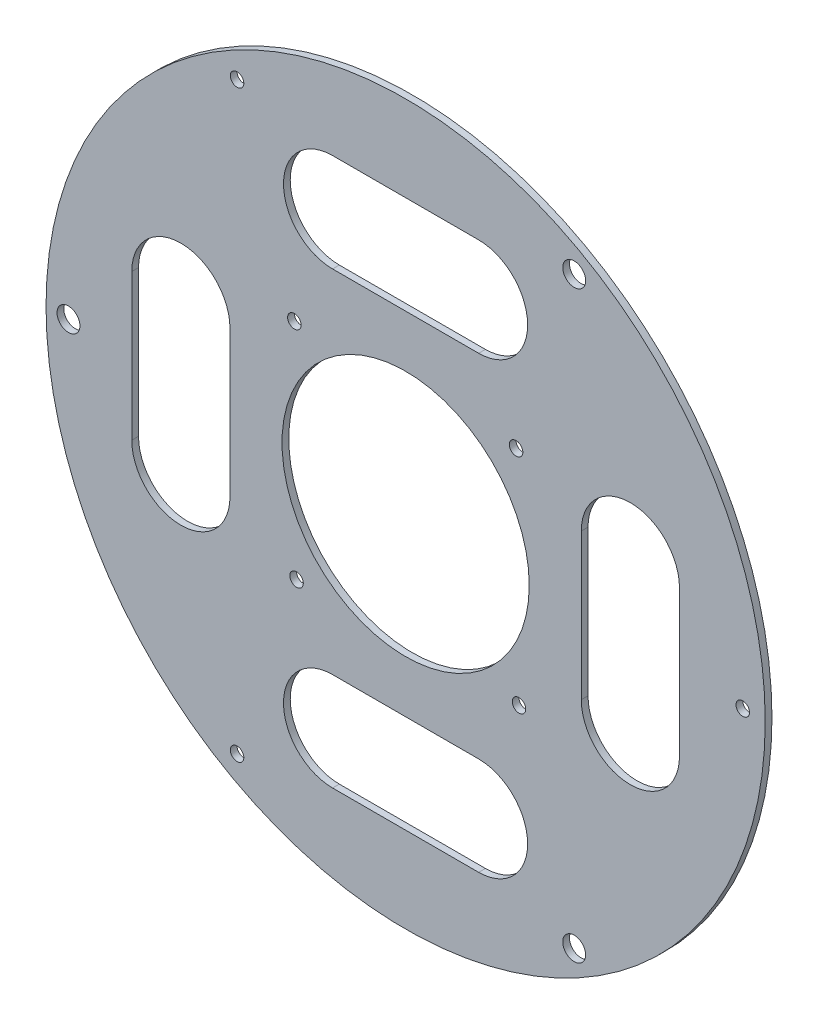
ISO-10303-21;
HEADER;
FILE_DESCRIPTION(('STEP AP214'),'2;1');
FILE_NAME('part.step','',(''),(''),'','','');
FILE_SCHEMA(('AUTOMOTIVE_DESIGN { 1 0 10303 214 1 1 1 1 }'));
ENDSEC;
DATA;
#1=APPLICATION_CONTEXT('core data for automotive mechanical design processes');
#2=APPLICATION_PROTOCOL_DEFINITION('international standard','automotive_design',2000,#1);
#3=PRODUCT_CONTEXT('',#1,'mechanical');
#4=PRODUCT('Part','Part','',(#3));
#5=PRODUCT_RELATED_PRODUCT_CATEGORY('part','',(#4));
#6=PRODUCT_DEFINITION_FORMATION('','',#4);
#7=PRODUCT_DEFINITION_CONTEXT('part definition',#1,'design');
#8=PRODUCT_DEFINITION('design','',#6,#7);
#9=PRODUCT_DEFINITION_SHAPE('','',#8);
#10=(LENGTH_UNIT() NAMED_UNIT(*) SI_UNIT(.MILLI.,.METRE.));
#11=(NAMED_UNIT(*) PLANE_ANGLE_UNIT() SI_UNIT($,.RADIAN.));
#12=(NAMED_UNIT(*) SI_UNIT($,.STERADIAN.) SOLID_ANGLE_UNIT());
#13=UNCERTAINTY_MEASURE_WITH_UNIT(LENGTH_MEASURE(1.E-05),#10,'distance_accuracy_value','');
#14=(GEOMETRIC_REPRESENTATION_CONTEXT(3) GLOBAL_UNCERTAINTY_ASSIGNED_CONTEXT((#13)) GLOBAL_UNIT_ASSIGNED_CONTEXT((#10,
#11,#12)) REPRESENTATION_CONTEXT('',''));
#15=CARTESIAN_POINT('',(0.,0.,0.));
#16=DIRECTION('',(0.,0.,1.));
#17=DIRECTION('',(1.,0.,0.));
#18=AXIS2_PLACEMENT_3D('',#15,#16,#17);
#19=CARTESIAN_POINT('',(0.,-78.1572470545592,3.));
#20=DIRECTION('',(0.,1.,0.));
#21=DIRECTION('',(-1.,0.,0.));
#22=AXIS2_PLACEMENT_3D('',#19,#20,#21);
#23=PLANE('',#22);
#24=DIRECTION('',(1.,0.,0.));
#25=VECTOR('',#24,1.);
#26=CARTESIAN_POINT('',(0.,-78.1572470545592,0.));
#27=LINE('',#26,#25);
#28=CARTESIAN_POINT('',(-32.5,-78.1572470545592,0.));
#29=VERTEX_POINT('',#28);
#30=CARTESIAN_POINT('',(32.5,-78.1572470545592,0.));
#31=VERTEX_POINT('',#30);
#32=EDGE_CURVE('E259',#29,#31,#27,.T.);
#33=ORIENTED_EDGE('',*,*,#32,.T.);
#34=DIRECTION('',(0.,0.,-1.));
#35=VECTOR('',#34,1.);
#36=CARTESIAN_POINT('',(32.5,-78.1572470545592,3.));
#37=LINE('',#36,#35);
#38=CARTESIAN_POINT('',(32.5,-78.1572470545592,3.));
#39=VERTEX_POINT('',#38);
#40=EDGE_CURVE('E11',#39,#31,#37,.T.);
#41=ORIENTED_EDGE('',*,*,#40,.F.);
#42=DIRECTION('',(1.,0.,0.));
#43=VECTOR('',#42,1.);
#44=CARTESIAN_POINT('',(0.,-78.1572470545592,3.));
#45=LINE('',#44,#43);
#46=CARTESIAN_POINT('',(-32.5,-78.1572470545592,3.));
#47=VERTEX_POINT('',#46);
#48=EDGE_CURVE('E170',#47,#39,#45,.T.);
#49=ORIENTED_EDGE('',*,*,#48,.F.);
#50=DIRECTION('',(0.,0.,-1.));
#51=VECTOR('',#50,1.);
#52=CARTESIAN_POINT('',(-32.5,-78.1572470545592,3.));
#53=LINE('',#52,#51);
#54=EDGE_CURVE('E62',#47,#29,#53,.T.);
#55=ORIENTED_EDGE('',*,*,#54,.T.);
#56=EDGE_LOOP('',(#33,#41,#49,#55));
#57=FACE_BOUND('',#56,.T.);
#58=ADVANCED_FACE('F43',(#57),#23,.F.);
#59=CARTESIAN_POINT('',(32.4365969784117,-100.,3.));
#60=DIRECTION('',(0.,0.,-1.));
#61=DIRECTION('',(-1.,0.,0.));
#62=AXIS2_PLACEMENT_3D('',#59,#60,#61);
#63=CYLINDRICAL_SURFACE('',#62,21.8428449653133);
#64=CARTESIAN_POINT('',(32.4365969784117,-100.,0.));
#65=DIRECTION('',(0.,0.,1.));
#66=DIRECTION('',(1.,0.,0.));
#67=AXIS2_PLACEMENT_3D('',#64,#65,#66);
#68=CIRCLE('',#67,21.8428449653133);
#69=CARTESIAN_POINT('',(32.5000000000185,-121.842752945441,0.));
#70=VERTEX_POINT('',#69);
#71=EDGE_CURVE('E176',#31,#70,#68,.F.);
#72=ORIENTED_EDGE('',*,*,#71,.T.);
#73=DIRECTION('',(0.,0.,-1.));
#74=VECTOR('',#73,1.);
#75=CARTESIAN_POINT('',(32.5000000000185,-121.842752945441,3.));
#76=LINE('',#75,#74);
#77=CARTESIAN_POINT('',(32.5000000000185,-121.842752945441,3.));
#78=VERTEX_POINT('',#77);
#79=EDGE_CURVE('E53',#78,#70,#76,.T.);
#80=ORIENTED_EDGE('',*,*,#79,.F.);
#81=CARTESIAN_POINT('',(32.4365969784117,-100.,3.));
#82=DIRECTION('',(0.,0.,1.));
#83=DIRECTION('',(1.,0.,0.));
#84=AXIS2_PLACEMENT_3D('',#81,#82,#83);
#85=CIRCLE('',#84,21.8428449653133);
#86=EDGE_CURVE('E164',#39,#78,#85,.F.);
#87=ORIENTED_EDGE('',*,*,#86,.F.);
#88=ORIENTED_EDGE('',*,*,#40,.T.);
#89=EDGE_LOOP('',(#72,#80,#87,#88));
#90=FACE_BOUND('',#89,.T.);
#91=ADVANCED_FACE('F175',(#90),#63,.F.);
#92=CARTESIAN_POINT('',(0.,-121.842752945441,3.));
#93=DIRECTION('',(0.,1.,0.));
#94=DIRECTION('',(-1.,0.,0.));
#95=AXIS2_PLACEMENT_3D('',#92,#93,#94);
#96=PLANE('',#95);
#97=DIRECTION('',(1.,0.,0.));
#98=VECTOR('',#97,1.);
#99=CARTESIAN_POINT('',(0.,-121.842752945441,0.));
#100=LINE('',#99,#98);
#101=CARTESIAN_POINT('',(-32.5,-121.842752945441,0.));
#102=VERTEX_POINT('',#101);
#103=EDGE_CURVE('E262',#102,#70,#100,.T.);
#104=ORIENTED_EDGE('',*,*,#103,.F.);
#105=DIRECTION('',(0.,0.,-1.));
#106=VECTOR('',#105,1.);
#107=CARTESIAN_POINT('',(-32.5,-121.842752945441,3.));
#108=LINE('',#107,#106);
#109=CARTESIAN_POINT('',(-32.5,-121.842752945441,3.));
#110=VERTEX_POINT('',#109);
#111=EDGE_CURVE('E112',#110,#102,#108,.T.);
#112=ORIENTED_EDGE('',*,*,#111,.F.);
#113=DIRECTION('',(1.,0.,0.));
#114=VECTOR('',#113,1.);
#115=CARTESIAN_POINT('',(0.,-121.842752945441,3.));
#116=LINE('',#115,#114);
#117=EDGE_CURVE('E169',#110,#78,#116,.T.);
#118=ORIENTED_EDGE('',*,*,#117,.T.);
#119=ORIENTED_EDGE('',*,*,#79,.T.);
#120=EDGE_LOOP('',(#104,#112,#118,#119));
#121=FACE_BOUND('',#120,.T.);
#122=ADVANCED_FACE('F180',(#121),#96,.T.);
#123=CARTESIAN_POINT('',(0.,78.1572470545592,3.));
#124=DIRECTION('',(0.,1.,0.));
#125=DIRECTION('',(-1.,0.,0.));
#126=AXIS2_PLACEMENT_3D('',#123,#124,#125);
#127=PLANE('',#126);
#128=DIRECTION('',(1.,0.,0.));
#129=VECTOR('',#128,1.);
#130=CARTESIAN_POINT('',(0.,78.1572470545592,0.));
#131=LINE('',#130,#129);
#132=CARTESIAN_POINT('',(-32.5,78.1572470545592,0.));
#133=VERTEX_POINT('',#132);
#134=CARTESIAN_POINT('',(32.5,78.1572470545592,0.));
#135=VERTEX_POINT('',#134);
#136=EDGE_CURVE('E247',#133,#135,#131,.T.);
#137=ORIENTED_EDGE('',*,*,#136,.F.);
#138=DIRECTION('',(0.,0.,-1.));
#139=VECTOR('',#138,1.);
#140=CARTESIAN_POINT('',(-32.5,78.1572470545592,3.));
#141=LINE('',#140,#139);
#142=CARTESIAN_POINT('',(-32.5,78.1572470545592,3.));
#143=VERTEX_POINT('',#142);
#144=EDGE_CURVE('E269',#143,#133,#141,.T.);
#145=ORIENTED_EDGE('',*,*,#144,.F.);
#146=DIRECTION('',(1.,0.,0.));
#147=VECTOR('',#146,1.);
#148=CARTESIAN_POINT('',(0.,78.1572470545592,3.));
#149=LINE('',#148,#147);
#150=CARTESIAN_POINT('',(32.5,78.1572470545592,3.));
#151=VERTEX_POINT('',#150);
#152=EDGE_CURVE('E335',#143,#151,#149,.T.);
#153=ORIENTED_EDGE('',*,*,#152,.T.);
#154=DIRECTION('',(0.,0.,-1.));
#155=VECTOR('',#154,1.);
#156=CARTESIAN_POINT('',(32.5,78.1572470545592,3.));
#157=LINE('',#156,#155);
#158=EDGE_CURVE('E271',#151,#135,#157,.T.);
#159=ORIENTED_EDGE('',*,*,#158,.T.);
#160=EDGE_LOOP('',(#137,#145,#153,#159));
#161=FACE_BOUND('',#160,.T.);
#162=ADVANCED_FACE('F361',(#161),#127,.T.);
#163=CARTESIAN_POINT('',(-32.5,100.,3.));
#164=DIRECTION('',(0.,0.,-1.));
#165=DIRECTION('',(-1.,0.,0.));
#166=AXIS2_PLACEMENT_3D('',#163,#164,#165);
#167=CYLINDRICAL_SURFACE('',#166,21.8427529454408);
#168=CARTESIAN_POINT('',(-32.5,100.,0.));
#169=DIRECTION('',(0.,0.,1.));
#170=DIRECTION('',(1.,0.,0.));
#171=AXIS2_PLACEMENT_3D('',#168,#169,#170);
#172=CIRCLE('',#171,21.8427529454408);
#173=CARTESIAN_POINT('',(-32.5,121.842752945441,0.));
#174=VERTEX_POINT('',#173);
#175=EDGE_CURVE('E250',#133,#174,#172,.F.);
#176=ORIENTED_EDGE('',*,*,#175,.T.);
#177=DIRECTION('',(0.,0.,-1.));
#178=VECTOR('',#177,1.);
#179=CARTESIAN_POINT('',(-32.5,121.842752945441,3.));
#180=LINE('',#179,#178);
#181=CARTESIAN_POINT('',(-32.5,121.842752945441,3.));
#182=VERTEX_POINT('',#181);
#183=EDGE_CURVE('E276',#182,#174,#180,.T.);
#184=ORIENTED_EDGE('',*,*,#183,.F.);
#185=CARTESIAN_POINT('',(-32.5,100.,3.));
#186=DIRECTION('',(0.,0.,1.));
#187=DIRECTION('',(1.,0.,0.));
#188=AXIS2_PLACEMENT_3D('',#185,#186,#187);
#189=CIRCLE('',#188,21.8427529454408);
#190=EDGE_CURVE('E338',#143,#182,#189,.F.);
#191=ORIENTED_EDGE('',*,*,#190,.F.);
#192=ORIENTED_EDGE('',*,*,#144,.T.);
#193=EDGE_LOOP('',(#176,#184,#191,#192));
#194=FACE_BOUND('',#193,.T.);
#195=ADVANCED_FACE('F363',(#194),#167,.F.);
#196=CARTESIAN_POINT('',(0.,121.842752945441,3.));
#197=DIRECTION('',(0.,1.,0.));
#198=DIRECTION('',(-1.,0.,0.));
#199=AXIS2_PLACEMENT_3D('',#196,#197,#198);
#200=PLANE('',#199);
#201=DIRECTION('',(1.,0.,0.));
#202=VECTOR('',#201,1.);
#203=CARTESIAN_POINT('',(0.,121.842752945441,0.));
#204=LINE('',#203,#202);
#205=CARTESIAN_POINT('',(32.5000000000185,121.842752945441,0.));
#206=VERTEX_POINT('',#205);
#207=EDGE_CURVE('E253',#174,#206,#204,.T.);
#208=ORIENTED_EDGE('',*,*,#207,.T.);
#209=DIRECTION('',(0.,0.,-1.));
#210=VECTOR('',#209,1.);
#211=CARTESIAN_POINT('',(32.5000000000185,121.842752945441,3.));
#212=LINE('',#211,#210);
#213=CARTESIAN_POINT('',(32.5000000000185,121.842752945441,3.));
#214=VERTEX_POINT('',#213);
#215=EDGE_CURVE('E273',#214,#206,#212,.T.);
#216=ORIENTED_EDGE('',*,*,#215,.F.);
#217=DIRECTION('',(1.,0.,0.));
#218=VECTOR('',#217,1.);
#219=CARTESIAN_POINT('',(0.,121.842752945441,3.));
#220=LINE('',#219,#218);
#221=EDGE_CURVE('E341',#182,#214,#220,.T.);
#222=ORIENTED_EDGE('',*,*,#221,.F.);
#223=ORIENTED_EDGE('',*,*,#183,.T.);
#224=EDGE_LOOP('',(#208,#216,#222,#223));
#225=FACE_BOUND('',#224,.T.);
#226=ADVANCED_FACE('F355',(#225),#200,.F.);
#227=CARTESIAN_POINT('',(100.,32.5,3.));
#228=DIRECTION('',(0.,0.,-1.));
#229=DIRECTION('',(-1.,0.,0.));
#230=AXIS2_PLACEMENT_3D('',#227,#228,#229);
#231=CYLINDRICAL_SURFACE('',#230,21.8427529454408);
#232=CARTESIAN_POINT('',(100.,32.5,0.));
#233=DIRECTION('',(0.,0.,1.));
#234=DIRECTION('',(1.,0.,0.));
#235=AXIS2_PLACEMENT_3D('',#232,#233,#234);
#236=CIRCLE('',#235,21.8427529454408);
#237=CARTESIAN_POINT('',(121.842752945441,32.5,0.));
#238=VERTEX_POINT('',#237);
#239=CARTESIAN_POINT('',(78.1572470545592,32.5,0.));
#240=VERTEX_POINT('',#239);
#241=EDGE_CURVE('E232',#238,#240,#236,.T.);
#242=ORIENTED_EDGE('',*,*,#241,.F.);
#243=DIRECTION('',(0.,0.,-1.));
#244=VECTOR('',#243,1.);
#245=CARTESIAN_POINT('',(121.842752945441,32.5,3.));
#246=LINE('',#245,#244);
#247=CARTESIAN_POINT('',(121.842752945441,32.5,3.));
#248=VERTEX_POINT('',#247);
#249=EDGE_CURVE('E274',#248,#238,#246,.T.);
#250=ORIENTED_EDGE('',*,*,#249,.F.);
#251=CARTESIAN_POINT('',(100.,32.5,3.));
#252=DIRECTION('',(0.,0.,1.));
#253=DIRECTION('',(1.,0.,0.));
#254=AXIS2_PLACEMENT_3D('',#251,#252,#253);
#255=CIRCLE('',#254,21.8427529454408);
#256=CARTESIAN_POINT('',(78.1572470545592,32.5,3.));
#257=VERTEX_POINT('',#256);
#258=EDGE_CURVE('E314',#248,#257,#255,.T.);
#259=ORIENTED_EDGE('',*,*,#258,.T.);
#260=DIRECTION('',(0.,0.,-1.));
#261=VECTOR('',#260,1.);
#262=CARTESIAN_POINT('',(78.1572470545592,32.5,3.));
#263=LINE('',#262,#261);
#264=EDGE_CURVE('E280',#257,#240,#263,.T.);
#265=ORIENTED_EDGE('',*,*,#264,.T.);
#266=EDGE_LOOP('',(#242,#250,#259,#265));
#267=FACE_BOUND('',#266,.T.);
#268=ADVANCED_FACE('F370',(#267),#231,.F.);
#269=CARTESIAN_POINT('',(121.842752945441,0.,3.));
#270=DIRECTION('',(1.,0.,0.));
#271=DIRECTION('',(0.,1.,0.));
#272=AXIS2_PLACEMENT_3D('',#269,#270,#271);
#273=PLANE('',#272);
#274=DIRECTION('',(0.,-1.,0.));
#275=VECTOR('',#274,1.);
#276=CARTESIAN_POINT('',(121.842752945441,0.,0.));
#277=LINE('',#276,#275);
#278=CARTESIAN_POINT('',(121.842752945441,-32.5,0.));
#279=VERTEX_POINT('',#278);
#280=EDGE_CURVE('E235',#238,#279,#277,.T.);
#281=ORIENTED_EDGE('',*,*,#280,.T.);
#282=DIRECTION('',(0.,0.,-1.));
#283=VECTOR('',#282,1.);
#284=CARTESIAN_POINT('',(121.842752945441,-32.5,3.));
#285=LINE('',#284,#283);
#286=CARTESIAN_POINT('',(121.842752945441,-32.5,3.));
#287=VERTEX_POINT('',#286);
#288=EDGE_CURVE('E284',#287,#279,#285,.T.);
#289=ORIENTED_EDGE('',*,*,#288,.F.);
#290=DIRECTION('',(0.,-1.,0.));
#291=VECTOR('',#290,1.);
#292=CARTESIAN_POINT('',(121.842752945441,0.,3.));
#293=LINE('',#292,#291);
#294=EDGE_CURVE('E324',#248,#287,#293,.T.);
#295=ORIENTED_EDGE('',*,*,#294,.F.);
#296=ORIENTED_EDGE('',*,*,#249,.T.);
#297=EDGE_LOOP('',(#281,#289,#295,#296));
#298=FACE_BOUND('',#297,.T.);
#299=ADVANCED_FACE('F518',(#298),#273,.F.);
#300=CARTESIAN_POINT('',(100.,-32.5,3.));
#301=DIRECTION('',(0.,0.,-1.));
#302=DIRECTION('',(-1.,0.,0.));
#303=AXIS2_PLACEMENT_3D('',#300,#301,#302);
#304=CYLINDRICAL_SURFACE('',#303,21.8427529454408);
#305=CARTESIAN_POINT('',(100.,-32.5,0.));
#306=DIRECTION('',(0.,0.,1.));
#307=DIRECTION('',(1.,0.,0.));
#308=AXIS2_PLACEMENT_3D('',#305,#306,#307);
#309=CIRCLE('',#308,21.8427529454408);
#310=CARTESIAN_POINT('',(78.1572470545592,-32.5,0.));
#311=VERTEX_POINT('',#310);
#312=EDGE_CURVE('E238',#279,#311,#309,.F.);
#313=ORIENTED_EDGE('',*,*,#312,.T.);
#314=DIRECTION('',(0.,0.,-1.));
#315=VECTOR('',#314,1.);
#316=CARTESIAN_POINT('',(78.1572470545592,-32.5,3.));
#317=LINE('',#316,#315);
#318=CARTESIAN_POINT('',(78.1572470545592,-32.5,3.));
#319=VERTEX_POINT('',#318);
#320=EDGE_CURVE('E282',#319,#311,#317,.T.);
#321=ORIENTED_EDGE('',*,*,#320,.F.);
#322=CARTESIAN_POINT('',(100.,-32.5,3.));
#323=DIRECTION('',(0.,0.,1.));
#324=DIRECTION('',(1.,0.,0.));
#325=AXIS2_PLACEMENT_3D('',#322,#323,#324);
#326=CIRCLE('',#325,21.8427529454408);
#327=EDGE_CURVE('E327',#287,#319,#326,.F.);
#328=ORIENTED_EDGE('',*,*,#327,.F.);
#329=ORIENTED_EDGE('',*,*,#288,.T.);
#330=EDGE_LOOP('',(#313,#321,#328,#329));
#331=FACE_BOUND('',#330,.T.);
#332=ADVANCED_FACE('F400',(#331),#304,.F.);
#333=CARTESIAN_POINT('',(-100.,-32.5,3.));
#334=DIRECTION('',(0.,0.,-1.));
#335=DIRECTION('',(-1.,0.,0.));
#336=AXIS2_PLACEMENT_3D('',#333,#334,#335);
#337=CYLINDRICAL_SURFACE('',#336,21.8427529454408);
#338=CARTESIAN_POINT('',(-100.,-32.5,0.));
#339=DIRECTION('',(0.,0.,1.));
#340=DIRECTION('',(1.,0.,0.));
#341=AXIS2_PLACEMENT_3D('',#338,#339,#340);
#342=CIRCLE('',#341,21.8427529454408);
#343=CARTESIAN_POINT('',(-121.842752945441,-32.5,0.));
#344=VERTEX_POINT('',#343);
#345=CARTESIAN_POINT('',(-78.1572470545592,-32.5,0.));
#346=VERTEX_POINT('',#345);
#347=EDGE_CURVE('E220',#344,#346,#342,.T.);
#348=ORIENTED_EDGE('',*,*,#347,.F.);
#349=DIRECTION('',(0.,0.,-1.));
#350=VECTOR('',#349,1.);
#351=CARTESIAN_POINT('',(-121.842752945441,-32.5,3.));
#352=LINE('',#351,#350);
#353=CARTESIAN_POINT('',(-121.842752945441,-32.5,3.));
#354=VERTEX_POINT('',#353);
#355=EDGE_CURVE('E47',#354,#344,#352,.T.);
#356=ORIENTED_EDGE('',*,*,#355,.F.);
#357=CARTESIAN_POINT('',(-100.,-32.5,3.));
#358=DIRECTION('',(0.,0.,1.));
#359=DIRECTION('',(1.,0.,0.));
#360=AXIS2_PLACEMENT_3D('',#357,#358,#359);
#361=CIRCLE('',#360,21.8427529454408);
#362=CARTESIAN_POINT('',(-78.1572470545592,-32.5,3.));
#363=VERTEX_POINT('',#362);
#364=EDGE_CURVE('E318',#354,#363,#361,.T.);
#365=ORIENTED_EDGE('',*,*,#364,.T.);
#366=DIRECTION('',(0.,0.,-1.));
#367=VECTOR('',#366,1.);
#368=CARTESIAN_POINT('',(-78.1572470545592,-32.5,3.));
#369=LINE('',#368,#367);
#370=EDGE_CURVE('E183',#363,#346,#369,.T.);
#371=ORIENTED_EDGE('',*,*,#370,.T.);
#372=EDGE_LOOP('',(#348,#356,#365,#371));
#373=FACE_BOUND('',#372,.T.);
#374=ADVANCED_FACE('F301',(#373),#337,.F.);
#375=CARTESIAN_POINT('',(-121.842752945441,0.,3.));
#376=DIRECTION('',(1.,0.,0.));
#377=DIRECTION('',(0.,1.,0.));
#378=AXIS2_PLACEMENT_3D('',#375,#376,#377);
#379=PLANE('',#378);
#380=DIRECTION('',(0.,-1.,0.));
#381=VECTOR('',#380,1.);
#382=CARTESIAN_POINT('',(-121.842752945441,0.,0.));
#383=LINE('',#382,#381);
#384=CARTESIAN_POINT('',(-121.842752945441,32.5,0.));
#385=VERTEX_POINT('',#384);
#386=EDGE_CURVE('E223',#385,#344,#383,.T.);
#387=ORIENTED_EDGE('',*,*,#386,.F.);
#388=DIRECTION('',(0.,0.,-1.));
#389=VECTOR('',#388,1.);
#390=CARTESIAN_POINT('',(-121.842752945441,32.5,3.));
#391=LINE('',#390,#389);
#392=CARTESIAN_POINT('',(-121.842752945441,32.5,3.));
#393=VERTEX_POINT('',#392);
#394=EDGE_CURVE('E291',#393,#385,#391,.T.);
#395=ORIENTED_EDGE('',*,*,#394,.F.);
#396=DIRECTION('',(0.,-1.,0.));
#397=VECTOR('',#396,1.);
#398=CARTESIAN_POINT('',(-121.842752945441,0.,3.));
#399=LINE('',#398,#397);
#400=EDGE_CURVE('E300',#393,#354,#399,.T.);
#401=ORIENTED_EDGE('',*,*,#400,.T.);
#402=ORIENTED_EDGE('',*,*,#355,.T.);
#403=EDGE_LOOP('',(#387,#395,#401,#402));
#404=FACE_BOUND('',#403,.T.);
#405=ADVANCED_FACE('F298',(#404),#379,.T.);
#406=CARTESIAN_POINT('',(-100.,32.5,3.));
#407=DIRECTION('',(0.,0.,-1.));
#408=DIRECTION('',(-1.,0.,0.));
#409=AXIS2_PLACEMENT_3D('',#406,#407,#408);
#410=CYLINDRICAL_SURFACE('',#409,21.8427529454408);
#411=CARTESIAN_POINT('',(-100.,32.5,0.));
#412=DIRECTION('',(0.,0.,1.));
#413=DIRECTION('',(1.,0.,0.));
#414=AXIS2_PLACEMENT_3D('',#411,#412,#413);
#415=CIRCLE('',#414,21.8427529454408);
#416=CARTESIAN_POINT('',(-78.1572470545592,32.5,0.));
#417=VERTEX_POINT('',#416);
#418=EDGE_CURVE('E226',#385,#417,#415,.F.);
#419=ORIENTED_EDGE('',*,*,#418,.T.);
#420=DIRECTION('',(0.,0.,-1.));
#421=VECTOR('',#420,1.);
#422=CARTESIAN_POINT('',(-78.1572470545592,32.5,3.));
#423=LINE('',#422,#421);
#424=CARTESIAN_POINT('',(-78.1572470545592,32.5,3.));
#425=VERTEX_POINT('',#424);
#426=EDGE_CURVE('E289',#425,#417,#423,.T.);
#427=ORIENTED_EDGE('',*,*,#426,.F.);
#428=CARTESIAN_POINT('',(-100.,32.5,3.));
#429=DIRECTION('',(0.,0.,1.));
#430=DIRECTION('',(1.,0.,0.));
#431=AXIS2_PLACEMENT_3D('',#428,#429,#430);
#432=CIRCLE('',#431,21.8427529454408);
#433=EDGE_CURVE('E309',#393,#425,#432,.F.);
#434=ORIENTED_EDGE('',*,*,#433,.F.);
#435=ORIENTED_EDGE('',*,*,#394,.T.);
#436=EDGE_LOOP('',(#419,#427,#434,#435));
#437=FACE_BOUND('',#436,.T.);
#438=ADVANCED_FACE('F307',(#437),#410,.F.);
#439=CARTESIAN_POINT('',(32.4365969784117,100.,3.));
#440=DIRECTION('',(0.,0.,-1.));
#441=DIRECTION('',(-1.,0.,0.));
#442=AXIS2_PLACEMENT_3D('',#439,#440,#441);
#443=CYLINDRICAL_SURFACE('',#442,21.8428449653133);
#444=CARTESIAN_POINT('',(32.4365969784117,100.,0.));
#445=DIRECTION('',(0.,0.,1.));
#446=DIRECTION('',(1.,0.,0.));
#447=AXIS2_PLACEMENT_3D('',#444,#445,#446);
#448=CIRCLE('',#447,21.8428449653133);
#449=EDGE_CURVE('E256',#135,#206,#448,.T.);
#450=ORIENTED_EDGE('',*,*,#449,.F.);
#451=ORIENTED_EDGE('',*,*,#158,.F.);
#452=CARTESIAN_POINT('',(32.4365969784117,100.,3.));
#453=DIRECTION('',(0.,0.,1.));
#454=DIRECTION('',(1.,0.,0.));
#455=AXIS2_PLACEMENT_3D('',#452,#453,#454);
#456=CIRCLE('',#455,21.8428449653133);
#457=EDGE_CURVE('E343',#151,#214,#456,.T.);
#458=ORIENTED_EDGE('',*,*,#457,.T.);
#459=ORIENTED_EDGE('',*,*,#215,.T.);
#460=EDGE_LOOP('',(#450,#451,#458,#459));
#461=FACE_BOUND('',#460,.T.);
#462=ADVANCED_FACE('F348',(#461),#443,.F.);
#463=CARTESIAN_POINT('',(0.,0.,3.));
#464=DIRECTION('',(0.,0.,-1.));
#465=DIRECTION('',(-1.,0.,0.));
#466=AXIS2_PLACEMENT_3D('',#463,#464,#465);
#467=CYLINDRICAL_SURFACE('',#466,160.);
#468=CARTESIAN_POINT('',(0.,0.,3.));
#469=DIRECTION('',(0.,0.,1.));
#470=DIRECTION('',(1.,0.,0.));
#471=AXIS2_PLACEMENT_3D('',#468,#469,#470);
#472=CIRCLE('',#471,160.);
#473=CARTESIAN_POINT('',(160.,0.,3.));
#474=VERTEX_POINT('',#473);
#475=EDGE_CURVE('E332',#474,#474,#472,.T.);
#476=ORIENTED_EDGE('',*,*,#475,.F.);
#477=EDGE_LOOP('',(#476));
#478=FACE_BOUND('',#477,.T.);
#479=CARTESIAN_POINT('',(0.,0.,0.));
#480=DIRECTION('',(0.,0.,1.));
#481=DIRECTION('',(1.,0.,0.));
#482=AXIS2_PLACEMENT_3D('',#479,#480,#481);
#483=CIRCLE('',#482,160.);
#484=CARTESIAN_POINT('',(160.,0.,0.));
#485=VERTEX_POINT('',#484);
#486=EDGE_CURVE('E244',#485,#485,#483,.T.);
#487=ORIENTED_EDGE('',*,*,#486,.T.);
#488=EDGE_LOOP('',(#487));
#489=FACE_BOUND('',#488,.T.);
#490=ADVANCED_FACE('F382',(#478,#489),#467,.T.);
#491=CARTESIAN_POINT('',(78.1572470545592,0.,3.));
#492=DIRECTION('',(1.,0.,0.));
#493=DIRECTION('',(0.,1.,0.));
#494=AXIS2_PLACEMENT_3D('',#491,#492,#493);
#495=PLANE('',#494);
#496=DIRECTION('',(0.,-1.,0.));
#497=VECTOR('',#496,1.);
#498=CARTESIAN_POINT('',(78.1572470545592,0.,0.));
#499=LINE('',#498,#497);
#500=EDGE_CURVE('E241',#240,#311,#499,.T.);
#501=ORIENTED_EDGE('',*,*,#500,.F.);
#502=ORIENTED_EDGE('',*,*,#264,.F.);
#503=DIRECTION('',(0.,-1.,0.));
#504=VECTOR('',#503,1.);
#505=CARTESIAN_POINT('',(78.1572470545592,0.,3.));
#506=LINE('',#505,#504);
#507=EDGE_CURVE('E329',#257,#319,#506,.T.);
#508=ORIENTED_EDGE('',*,*,#507,.T.);
#509=ORIENTED_EDGE('',*,*,#320,.T.);
#510=EDGE_LOOP('',(#501,#502,#508,#509));
#511=FACE_BOUND('',#510,.T.);
#512=ADVANCED_FACE('F387',(#511),#495,.T.);
#513=CARTESIAN_POINT('',(-78.1572470545592,0.,3.));
#514=DIRECTION('',(1.,0.,0.));
#515=DIRECTION('',(0.,1.,0.));
#516=AXIS2_PLACEMENT_3D('',#513,#514,#515);
#517=PLANE('',#516);
#518=DIRECTION('',(0.,-1.,0.));
#519=VECTOR('',#518,1.);
#520=CARTESIAN_POINT('',(-78.1572470545592,0.,0.));
#521=LINE('',#520,#519);
#522=EDGE_CURVE('E229',#417,#346,#521,.T.);
#523=ORIENTED_EDGE('',*,*,#522,.T.);
#524=ORIENTED_EDGE('',*,*,#370,.F.);
#525=DIRECTION('',(0.,-1.,0.));
#526=VECTOR('',#525,1.);
#527=CARTESIAN_POINT('',(-78.1572470545592,0.,3.));
#528=LINE('',#527,#526);
#529=EDGE_CURVE('E312',#425,#363,#528,.T.);
#530=ORIENTED_EDGE('',*,*,#529,.F.);
#531=ORIENTED_EDGE('',*,*,#426,.T.);
#532=EDGE_LOOP('',(#523,#524,#530,#531));
#533=FACE_BOUND('',#532,.T.);
#534=ADVANCED_FACE('F311',(#533),#517,.F.);
#535=CARTESIAN_POINT('',(-150.,0.,3.));
#536=DIRECTION('',(0.,0.,-1.));
#537=DIRECTION('',(-1.,0.,0.));
#538=AXIS2_PLACEMENT_3D('',#535,#536,#537);
#539=CYLINDRICAL_SURFACE('',#538,5.09999999999998);
#540=CARTESIAN_POINT('',(-150.,0.,3.));
#541=DIRECTION('',(0.,0.,1.));
#542=DIRECTION('',(1.,0.,0.));
#543=AXIS2_PLACEMENT_3D('',#540,#541,#542);
#544=CIRCLE('',#543,5.09999999999998);
#545=CARTESIAN_POINT('',(-144.9,0.,3.));
#546=VERTEX_POINT('',#545);
#547=EDGE_CURVE('E784',#546,#546,#544,.T.);
#548=ORIENTED_EDGE('',*,*,#547,.T.);
#549=EDGE_LOOP('',(#548));
#550=FACE_BOUND('',#549,.T.);
#551=CARTESIAN_POINT('',(-150.,0.,0.));
#552=DIRECTION('',(0.,0.,1.));
#553=DIRECTION('',(1.,0.,0.));
#554=AXIS2_PLACEMENT_3D('',#551,#552,#553);
#555=CIRCLE('',#554,5.09999999999998);
#556=CARTESIAN_POINT('',(-144.9,0.,0.));
#557=VERTEX_POINT('',#556);
#558=EDGE_CURVE('E217',#557,#557,#555,.T.);
#559=ORIENTED_EDGE('',*,*,#558,.F.);
#560=EDGE_LOOP('',(#559));
#561=FACE_BOUND('',#560,.T.);
#562=ADVANCED_FACE('F401',(#550,#561),#539,.F.);
#563=CARTESIAN_POINT('',(-48.5327301826037,-49.522943910925,3.));
#564=DIRECTION('',(0.,0.,-1.));
#565=DIRECTION('',(-1.,0.,0.));
#566=AXIS2_PLACEMENT_3D('',#563,#564,#565);
#567=CYLINDRICAL_SURFACE('',#566,3.);
#568=CARTESIAN_POINT('',(-48.5327301826037,-49.522943910925,3.));
#569=DIRECTION('',(0.,0.,1.));
#570=DIRECTION('',(1.,0.,0.));
#571=AXIS2_PLACEMENT_3D('',#568,#569,#570);
#572=CIRCLE('',#571,3.);
#573=CARTESIAN_POINT('',(-45.5327301826037,-49.522943910925,3.));
#574=VERTEX_POINT('',#573);
#575=EDGE_CURVE('E781',#574,#574,#572,.T.);
#576=ORIENTED_EDGE('',*,*,#575,.T.);
#577=EDGE_LOOP('',(#576));
#578=FACE_BOUND('',#577,.T.);
#579=CARTESIAN_POINT('',(-48.5327301826037,-49.522943910925,0.));
#580=DIRECTION('',(0.,0.,1.));
#581=DIRECTION('',(1.,0.,0.));
#582=AXIS2_PLACEMENT_3D('',#579,#580,#581);
#583=CIRCLE('',#582,3.);
#584=CARTESIAN_POINT('',(-45.5327301826037,-49.522943910925,0.));
#585=VERTEX_POINT('',#584);
#586=EDGE_CURVE('E214',#585,#585,#583,.T.);
#587=ORIENTED_EDGE('',*,*,#586,.F.);
#588=EDGE_LOOP('',(#587));
#589=FACE_BOUND('',#588,.T.);
#590=ADVANCED_FACE('F404',(#578,#589),#567,.F.);
#591=CARTESIAN_POINT('',(74.9999999999988,129.903810567666,3.));
#592=DIRECTION('',(0.,0.,-1.));
#593=DIRECTION('',(-1.,0.,0.));
#594=AXIS2_PLACEMENT_3D('',#591,#592,#593);
#595=CYLINDRICAL_SURFACE('',#594,5.1);
#596=CARTESIAN_POINT('',(74.9999999999988,129.903810567666,3.));
#597=DIRECTION('',(0.,0.,1.));
#598=DIRECTION('',(1.,0.,0.));
#599=AXIS2_PLACEMENT_3D('',#596,#597,#598);
#600=CIRCLE('',#599,5.1);
#601=CARTESIAN_POINT('',(80.0999999999988,129.903810567666,3.));
#602=VERTEX_POINT('',#601);
#603=EDGE_CURVE('E777',#602,#602,#600,.T.);
#604=ORIENTED_EDGE('',*,*,#603,.T.);
#605=EDGE_LOOP('',(#604));
#606=FACE_BOUND('',#605,.T.);
#607=CARTESIAN_POINT('',(74.9999999999988,129.903810567666,0.));
#608=DIRECTION('',(0.,0.,1.));
#609=DIRECTION('',(1.,0.,0.));
#610=AXIS2_PLACEMENT_3D('',#607,#608,#609);
#611=CIRCLE('',#610,5.1);
#612=CARTESIAN_POINT('',(80.0999999999988,129.903810567666,0.));
#613=VERTEX_POINT('',#612);
#614=EDGE_CURVE('E211',#613,#613,#611,.T.);
#615=ORIENTED_EDGE('',*,*,#614,.F.);
#616=EDGE_LOOP('',(#615));
#617=FACE_BOUND('',#616,.T.);
#618=ADVANCED_FACE('F408',(#606,#617),#595,.F.);
#619=CARTESIAN_POINT('',(75.0000000000006,-129.903810567665,3.));
#620=DIRECTION('',(0.,0.,-1.));
#621=DIRECTION('',(-1.,0.,0.));
#622=AXIS2_PLACEMENT_3D('',#619,#620,#621);
#623=CYLINDRICAL_SURFACE('',#622,5.1);
#624=CARTESIAN_POINT('',(75.0000000000006,-129.903810567665,3.));
#625=DIRECTION('',(0.,0.,1.));
#626=DIRECTION('',(1.,0.,0.));
#627=AXIS2_PLACEMENT_3D('',#624,#625,#626);
#628=CIRCLE('',#627,5.1);
#629=CARTESIAN_POINT('',(80.1000000000006,-129.903810567665,3.));
#630=VERTEX_POINT('',#629);
#631=EDGE_CURVE('E773',#630,#630,#628,.T.);
#632=ORIENTED_EDGE('',*,*,#631,.T.);
#633=EDGE_LOOP('',(#632));
#634=FACE_BOUND('',#633,.T.);
#635=CARTESIAN_POINT('',(75.0000000000006,-129.903810567665,0.));
#636=DIRECTION('',(0.,0.,1.));
#637=DIRECTION('',(1.,0.,0.));
#638=AXIS2_PLACEMENT_3D('',#635,#636,#637);
#639=CIRCLE('',#638,5.1);
#640=CARTESIAN_POINT('',(80.1000000000006,-129.903810567665,0.));
#641=VERTEX_POINT('',#640);
#642=EDGE_CURVE('E208',#641,#641,#639,.T.);
#643=ORIENTED_EDGE('',*,*,#642,.F.);
#644=EDGE_LOOP('',(#643));
#645=FACE_BOUND('',#644,.T.);
#646=ADVANCED_FACE('F412',(#634,#645),#623,.F.);
#647=CARTESIAN_POINT('',(-75.0000000000015,129.903810567665,3.));
#648=DIRECTION('',(0.,0.,-1.));
#649=DIRECTION('',(-1.,0.,0.));
#650=AXIS2_PLACEMENT_3D('',#647,#648,#649);
#651=CYLINDRICAL_SURFACE('',#650,3.00000000000001);
#652=CARTESIAN_POINT('',(-75.0000000000015,129.903810567665,3.));
#653=DIRECTION('',(0.,0.,1.));
#654=DIRECTION('',(1.,0.,0.));
#655=AXIS2_PLACEMENT_3D('',#652,#653,#654);
#656=CIRCLE('',#655,3.00000000000001);
#657=CARTESIAN_POINT('',(-72.0000000000015,129.903810567665,3.));
#658=VERTEX_POINT('',#657);
#659=EDGE_CURVE('E769',#658,#658,#656,.T.);
#660=ORIENTED_EDGE('',*,*,#659,.T.);
#661=EDGE_LOOP('',(#660));
#662=FACE_BOUND('',#661,.T.);
#663=CARTESIAN_POINT('',(-75.0000000000015,129.903810567665,0.));
#664=DIRECTION('',(0.,0.,1.));
#665=DIRECTION('',(1.,0.,0.));
#666=AXIS2_PLACEMENT_3D('',#663,#664,#665);
#667=CIRCLE('',#666,3.00000000000001);
#668=CARTESIAN_POINT('',(-72.0000000000015,129.903810567665,0.));
#669=VERTEX_POINT('',#668);
#670=EDGE_CURVE('E205',#669,#669,#667,.T.);
#671=ORIENTED_EDGE('',*,*,#670,.F.);
#672=EDGE_LOOP('',(#671));
#673=FACE_BOUND('',#672,.T.);
#674=ADVANCED_FACE('F416',(#662,#673),#651,.F.);
#675=CARTESIAN_POINT('',(150.,1.06581410364015E-12,3.));
#676=DIRECTION('',(0.,0.,-1.));
#677=DIRECTION('',(-1.,0.,0.));
#678=AXIS2_PLACEMENT_3D('',#675,#676,#677);
#679=CYLINDRICAL_SURFACE('',#678,2.99999999999999);
#680=CARTESIAN_POINT('',(150.,1.06581410364015E-12,3.));
#681=DIRECTION('',(0.,0.,1.));
#682=DIRECTION('',(1.,0.,0.));
#683=AXIS2_PLACEMENT_3D('',#680,#681,#682);
#684=CIRCLE('',#683,2.99999999999999);
#685=CARTESIAN_POINT('',(153.,1.06581410364015E-12,3.));
#686=VERTEX_POINT('',#685);
#687=EDGE_CURVE('E765',#686,#686,#684,.T.);
#688=ORIENTED_EDGE('',*,*,#687,.T.);
#689=EDGE_LOOP('',(#688));
#690=FACE_BOUND('',#689,.T.);
#691=CARTESIAN_POINT('',(150.,1.06581410364015E-12,0.));
#692=DIRECTION('',(0.,0.,1.));
#693=DIRECTION('',(1.,0.,0.));
#694=AXIS2_PLACEMENT_3D('',#691,#692,#693);
#695=CIRCLE('',#694,2.99999999999999);
#696=CARTESIAN_POINT('',(153.,1.06581410364015E-12,0.));
#697=VERTEX_POINT('',#696);
#698=EDGE_CURVE('E202',#697,#697,#695,.T.);
#699=ORIENTED_EDGE('',*,*,#698,.F.);
#700=EDGE_LOOP('',(#699));
#701=FACE_BOUND('',#700,.T.);
#702=ADVANCED_FACE('F420',(#690,#701),#679,.F.);
#703=CARTESIAN_POINT('',(-74.9999999999997,-129.903810567666,3.));
#704=DIRECTION('',(0.,0.,-1.));
#705=DIRECTION('',(-1.,0.,0.));
#706=AXIS2_PLACEMENT_3D('',#703,#704,#705);
#707=CYLINDRICAL_SURFACE('',#706,3.00000000000001);
#708=CARTESIAN_POINT('',(-74.9999999999997,-129.903810567666,3.));
#709=DIRECTION('',(0.,0.,1.));
#710=DIRECTION('',(1.,0.,0.));
#711=AXIS2_PLACEMENT_3D('',#708,#709,#710);
#712=CIRCLE('',#711,3.00000000000001);
#713=CARTESIAN_POINT('',(-71.9999999999997,-129.903810567666,3.));
#714=VERTEX_POINT('',#713);
#715=EDGE_CURVE('E761',#714,#714,#712,.T.);
#716=ORIENTED_EDGE('',*,*,#715,.T.);
#717=EDGE_LOOP('',(#716));
#718=FACE_BOUND('',#717,.T.);
#719=CARTESIAN_POINT('',(-74.9999999999997,-129.903810567666,0.));
#720=DIRECTION('',(0.,0.,1.));
#721=DIRECTION('',(1.,0.,0.));
#722=AXIS2_PLACEMENT_3D('',#719,#720,#721);
#723=CIRCLE('',#722,3.00000000000001);
#724=CARTESIAN_POINT('',(-71.9999999999997,-129.903810567666,0.));
#725=VERTEX_POINT('',#724);
#726=EDGE_CURVE('E199',#725,#725,#723,.T.);
#727=ORIENTED_EDGE('',*,*,#726,.F.);
#728=EDGE_LOOP('',(#727));
#729=FACE_BOUND('',#728,.T.);
#730=ADVANCED_FACE('F424',(#718,#729),#707,.F.);
#731=CARTESIAN_POINT('',(-49.4997689979038,49.4951802618614,3.));
#732=DIRECTION('',(0.,0.,-1.));
#733=DIRECTION('',(-1.,0.,0.));
#734=AXIS2_PLACEMENT_3D('',#731,#732,#733);
#735=CYLINDRICAL_SURFACE('',#734,2.99999999999999);
#736=CARTESIAN_POINT('',(-49.4997689979038,49.4951802618614,3.));
#737=DIRECTION('',(0.,0.,1.));
#738=DIRECTION('',(1.,0.,0.));
#739=AXIS2_PLACEMENT_3D('',#736,#737,#738);
#740=CIRCLE('',#739,2.99999999999999);
#741=CARTESIAN_POINT('',(-46.4997689979038,49.4951802618614,3.));
#742=VERTEX_POINT('',#741);
#743=EDGE_CURVE('E757',#742,#742,#740,.T.);
#744=ORIENTED_EDGE('',*,*,#743,.T.);
#745=EDGE_LOOP('',(#744));
#746=FACE_BOUND('',#745,.T.);
#747=CARTESIAN_POINT('',(-49.4997689979038,49.4951802618614,0.));
#748=DIRECTION('',(0.,0.,1.));
#749=DIRECTION('',(1.,0.,0.));
#750=AXIS2_PLACEMENT_3D('',#747,#748,#749);
#751=CIRCLE('',#750,2.99999999999999);
#752=CARTESIAN_POINT('',(-46.4997689979038,49.4951802618614,0.));
#753=VERTEX_POINT('',#752);
#754=EDGE_CURVE('E196',#753,#753,#751,.T.);
#755=ORIENTED_EDGE('',*,*,#754,.F.);
#756=EDGE_LOOP('',(#755));
#757=FACE_BOUND('',#756,.T.);
#758=ADVANCED_FACE('F428',(#746,#757),#735,.F.);
#759=CARTESIAN_POINT('',(50.435655769884,-48.541164253258,3.));
#760=DIRECTION('',(0.,0.,-1.));
#761=DIRECTION('',(-1.,0.,0.));
#762=AXIS2_PLACEMENT_3D('',#759,#760,#761);
#763=CYLINDRICAL_SURFACE('',#762,3.);
#764=CARTESIAN_POINT('',(50.435655769884,-48.541164253258,3.));
#765=DIRECTION('',(0.,0.,1.));
#766=DIRECTION('',(1.,0.,0.));
#767=AXIS2_PLACEMENT_3D('',#764,#765,#766);
#768=CIRCLE('',#767,3.);
#769=CARTESIAN_POINT('',(53.435655769884,-48.541164253258,3.));
#770=VERTEX_POINT('',#769);
#771=EDGE_CURVE('E753',#770,#770,#768,.T.);
#772=ORIENTED_EDGE('',*,*,#771,.T.);
#773=EDGE_LOOP('',(#772));
#774=FACE_BOUND('',#773,.T.);
#775=CARTESIAN_POINT('',(50.435655769884,-48.541164253258,0.));
#776=DIRECTION('',(0.,0.,1.));
#777=DIRECTION('',(1.,0.,0.));
#778=AXIS2_PLACEMENT_3D('',#775,#776,#777);
#779=CIRCLE('',#778,3.);
#780=CARTESIAN_POINT('',(53.435655769884,-48.541164253258,0.));
#781=VERTEX_POINT('',#780);
#782=EDGE_CURVE('E193',#781,#781,#779,.T.);
#783=ORIENTED_EDGE('',*,*,#782,.F.);
#784=EDGE_LOOP('',(#783));
#785=FACE_BOUND('',#784,.T.);
#786=ADVANCED_FACE('F432',(#774,#785),#763,.F.);
#787=CARTESIAN_POINT('',(49.1443837079334,49.8480646561871,3.));
#788=DIRECTION('',(0.,0.,-1.));
#789=DIRECTION('',(-1.,0.,0.));
#790=AXIS2_PLACEMENT_3D('',#787,#788,#789);
#791=CYLINDRICAL_SURFACE('',#790,3.);
#792=CARTESIAN_POINT('',(49.1443837079334,49.8480646561871,3.));
#793=DIRECTION('',(0.,0.,1.));
#794=DIRECTION('',(1.,0.,0.));
#795=AXIS2_PLACEMENT_3D('',#792,#793,#794);
#796=CIRCLE('',#795,3.);
#797=CARTESIAN_POINT('',(52.1443837079334,49.8480646561871,3.));
#798=VERTEX_POINT('',#797);
#799=EDGE_CURVE('E447',#798,#798,#796,.T.);
#800=ORIENTED_EDGE('',*,*,#799,.T.);
#801=EDGE_LOOP('',(#800));
#802=FACE_BOUND('',#801,.T.);
#803=CARTESIAN_POINT('',(49.1443837079334,49.8480646561871,0.));
#804=DIRECTION('',(0.,0.,1.));
#805=DIRECTION('',(1.,0.,0.));
#806=AXIS2_PLACEMENT_3D('',#803,#804,#805);
#807=CIRCLE('',#806,3.);
#808=CARTESIAN_POINT('',(52.1443837079334,49.8480646561871,0.));
#809=VERTEX_POINT('',#808);
#810=EDGE_CURVE('E190',#809,#809,#807,.T.);
#811=ORIENTED_EDGE('',*,*,#810,.F.);
#812=EDGE_LOOP('',(#811));
#813=FACE_BOUND('',#812,.T.);
#814=ADVANCED_FACE('F435',(#802,#813),#791,.F.);
#815=CARTESIAN_POINT('',(0.,0.,3.));
#816=DIRECTION('',(0.,0.,-1.));
#817=DIRECTION('',(-1.,0.,0.));
#818=AXIS2_PLACEMENT_3D('',#815,#816,#817);
#819=CYLINDRICAL_SURFACE('',#818,55.);
#820=CARTESIAN_POINT('',(0.,0.,3.));
#821=DIRECTION('',(0.,0.,1.));
#822=DIRECTION('',(1.,0.,0.));
#823=AXIS2_PLACEMENT_3D('',#820,#821,#822);
#824=CIRCLE('',#823,55.);
#825=CARTESIAN_POINT('',(55.,0.,3.));
#826=VERTEX_POINT('',#825);
#827=EDGE_CURVE('E267',#826,#826,#824,.T.);
#828=ORIENTED_EDGE('',*,*,#827,.T.);
#829=EDGE_LOOP('',(#828));
#830=FACE_BOUND('',#829,.T.);
#831=CARTESIAN_POINT('',(0.,0.,0.));
#832=DIRECTION('',(0.,0.,1.));
#833=DIRECTION('',(1.,0.,0.));
#834=AXIS2_PLACEMENT_3D('',#831,#832,#833);
#835=CIRCLE('',#834,55.);
#836=CARTESIAN_POINT('',(55.,0.,0.));
#837=VERTEX_POINT('',#836);
#838=EDGE_CURVE('E187',#837,#837,#835,.T.);
#839=ORIENTED_EDGE('',*,*,#838,.F.);
#840=EDGE_LOOP('',(#839));
#841=FACE_BOUND('',#840,.T.);
#842=ADVANCED_FACE('F45',(#830,#841),#819,.F.);
#843=CARTESIAN_POINT('',(-32.5,-100.,3.));
#844=DIRECTION('',(0.,0.,-1.));
#845=DIRECTION('',(-1.,0.,0.));
#846=AXIS2_PLACEMENT_3D('',#843,#844,#845);
#847=CYLINDRICAL_SURFACE('',#846,21.8427529454408);
#848=CARTESIAN_POINT('',(-32.5,-100.,0.));
#849=DIRECTION('',(0.,0.,1.));
#850=DIRECTION('',(1.,0.,0.));
#851=AXIS2_PLACEMENT_3D('',#848,#849,#850);
#852=CIRCLE('',#851,21.8427529454408);
#853=EDGE_CURVE('E264',#29,#102,#852,.T.);
#854=ORIENTED_EDGE('',*,*,#853,.F.);
#855=ORIENTED_EDGE('',*,*,#54,.F.);
#856=CARTESIAN_POINT('',(-32.5,-100.,3.));
#857=DIRECTION('',(0.,0.,1.));
#858=DIRECTION('',(1.,0.,0.));
#859=AXIS2_PLACEMENT_3D('',#856,#857,#858);
#860=CIRCLE('',#859,21.8427529454408);
#861=EDGE_CURVE('E181',#47,#110,#860,.T.);
#862=ORIENTED_EDGE('',*,*,#861,.T.);
#863=ORIENTED_EDGE('',*,*,#111,.T.);
#864=EDGE_LOOP('',(#854,#855,#862,#863));
#865=FACE_BOUND('',#864,.T.);
#866=ADVANCED_FACE('F442',(#865),#847,.F.);
#867=CARTESIAN_POINT('',(0.,0.,3.));
#868=DIRECTION('',(0.,0.,1.));
#869=DIRECTION('',(1.,0.,0.));
#870=AXIS2_PLACEMENT_3D('',#867,#868,#869);
#871=PLANE('',#870);
#872=ORIENTED_EDGE('',*,*,#827,.F.);
#873=EDGE_LOOP('',(#872));
#874=FACE_BOUND('',#873,.T.);
#875=ORIENTED_EDGE('',*,*,#799,.F.);
#876=EDGE_LOOP('',(#875));
#877=FACE_BOUND('',#876,.T.);
#878=ORIENTED_EDGE('',*,*,#771,.F.);
#879=EDGE_LOOP('',(#878));
#880=FACE_BOUND('',#879,.T.);
#881=ORIENTED_EDGE('',*,*,#743,.F.);
#882=EDGE_LOOP('',(#881));
#883=FACE_BOUND('',#882,.T.);
#884=ORIENTED_EDGE('',*,*,#715,.F.);
#885=EDGE_LOOP('',(#884));
#886=FACE_BOUND('',#885,.T.);
#887=ORIENTED_EDGE('',*,*,#687,.F.);
#888=EDGE_LOOP('',(#887));
#889=FACE_BOUND('',#888,.T.);
#890=ORIENTED_EDGE('',*,*,#659,.F.);
#891=EDGE_LOOP('',(#890));
#892=FACE_BOUND('',#891,.T.);
#893=ORIENTED_EDGE('',*,*,#631,.F.);
#894=EDGE_LOOP('',(#893));
#895=FACE_BOUND('',#894,.T.);
#896=ORIENTED_EDGE('',*,*,#603,.F.);
#897=EDGE_LOOP('',(#896));
#898=FACE_BOUND('',#897,.T.);
#899=ORIENTED_EDGE('',*,*,#575,.F.);
#900=EDGE_LOOP('',(#899));
#901=FACE_BOUND('',#900,.T.);
#902=ORIENTED_EDGE('',*,*,#547,.F.);
#903=EDGE_LOOP('',(#902));
#904=FACE_BOUND('',#903,.T.);
#905=ORIENTED_EDGE('',*,*,#364,.F.);
#906=ORIENTED_EDGE('',*,*,#400,.F.);
#907=ORIENTED_EDGE('',*,*,#433,.T.);
#908=ORIENTED_EDGE('',*,*,#529,.T.);
#909=EDGE_LOOP('',(#905,#906,#907,#908));
#910=FACE_BOUND('',#909,.T.);
#911=ORIENTED_EDGE('',*,*,#258,.F.);
#912=ORIENTED_EDGE('',*,*,#294,.T.);
#913=ORIENTED_EDGE('',*,*,#327,.T.);
#914=ORIENTED_EDGE('',*,*,#507,.F.);
#915=EDGE_LOOP('',(#911,#912,#913,#914));
#916=FACE_BOUND('',#915,.T.);
#917=ORIENTED_EDGE('',*,*,#475,.T.);
#918=EDGE_LOOP('',(#917));
#919=FACE_BOUND('',#918,.T.);
#920=ORIENTED_EDGE('',*,*,#152,.F.);
#921=ORIENTED_EDGE('',*,*,#190,.T.);
#922=ORIENTED_EDGE('',*,*,#221,.T.);
#923=ORIENTED_EDGE('',*,*,#457,.F.);
#924=EDGE_LOOP('',(#920,#921,#922,#923));
#925=FACE_BOUND('',#924,.T.);
#926=ORIENTED_EDGE('',*,*,#48,.T.);
#927=ORIENTED_EDGE('',*,*,#86,.T.);
#928=ORIENTED_EDGE('',*,*,#117,.F.);
#929=ORIENTED_EDGE('',*,*,#861,.F.);
#930=EDGE_LOOP('',(#926,#927,#928,#929));
#931=FACE_BOUND('',#930,.T.);
#932=ADVANCED_FACE('F166',(#874,#877,#880,#883,#886,#889,#892,#895,#898,#901,#904,#910,#916,
#919,#925,#931),#871,.T.);
#933=CARTESIAN_POINT('',(0.,0.,0.));
#934=DIRECTION('',(0.,0.,1.));
#935=DIRECTION('',(1.,0.,0.));
#936=AXIS2_PLACEMENT_3D('',#933,#934,#935);
#937=PLANE('',#936);
#938=ORIENTED_EDGE('',*,*,#838,.T.);
#939=EDGE_LOOP('',(#938));
#940=FACE_BOUND('',#939,.T.);
#941=ORIENTED_EDGE('',*,*,#810,.T.);
#942=EDGE_LOOP('',(#941));
#943=FACE_BOUND('',#942,.T.);
#944=ORIENTED_EDGE('',*,*,#782,.T.);
#945=EDGE_LOOP('',(#944));
#946=FACE_BOUND('',#945,.T.);
#947=ORIENTED_EDGE('',*,*,#754,.T.);
#948=EDGE_LOOP('',(#947));
#949=FACE_BOUND('',#948,.T.);
#950=ORIENTED_EDGE('',*,*,#726,.T.);
#951=EDGE_LOOP('',(#950));
#952=FACE_BOUND('',#951,.T.);
#953=ORIENTED_EDGE('',*,*,#698,.T.);
#954=EDGE_LOOP('',(#953));
#955=FACE_BOUND('',#954,.T.);
#956=ORIENTED_EDGE('',*,*,#670,.T.);
#957=EDGE_LOOP('',(#956));
#958=FACE_BOUND('',#957,.T.);
#959=ORIENTED_EDGE('',*,*,#642,.T.);
#960=EDGE_LOOP('',(#959));
#961=FACE_BOUND('',#960,.T.);
#962=ORIENTED_EDGE('',*,*,#614,.T.);
#963=EDGE_LOOP('',(#962));
#964=FACE_BOUND('',#963,.T.);
#965=ORIENTED_EDGE('',*,*,#586,.T.);
#966=EDGE_LOOP('',(#965));
#967=FACE_BOUND('',#966,.T.);
#968=ORIENTED_EDGE('',*,*,#558,.T.);
#969=EDGE_LOOP('',(#968));
#970=FACE_BOUND('',#969,.T.);
#971=ORIENTED_EDGE('',*,*,#347,.T.);
#972=ORIENTED_EDGE('',*,*,#522,.F.);
#973=ORIENTED_EDGE('',*,*,#418,.F.);
#974=ORIENTED_EDGE('',*,*,#386,.T.);
#975=EDGE_LOOP('',(#971,#972,#973,#974));
#976=FACE_BOUND('',#975,.T.);
#977=ORIENTED_EDGE('',*,*,#241,.T.);
#978=ORIENTED_EDGE('',*,*,#500,.T.);
#979=ORIENTED_EDGE('',*,*,#312,.F.);
#980=ORIENTED_EDGE('',*,*,#280,.F.);
#981=EDGE_LOOP('',(#977,#978,#979,#980));
#982=FACE_BOUND('',#981,.T.);
#983=ORIENTED_EDGE('',*,*,#486,.F.);
#984=EDGE_LOOP('',(#983));
#985=FACE_BOUND('',#984,.T.);
#986=ORIENTED_EDGE('',*,*,#136,.T.);
#987=ORIENTED_EDGE('',*,*,#449,.T.);
#988=ORIENTED_EDGE('',*,*,#207,.F.);
#989=ORIENTED_EDGE('',*,*,#175,.F.);
#990=EDGE_LOOP('',(#986,#987,#988,#989));
#991=FACE_BOUND('',#990,.T.);
#992=ORIENTED_EDGE('',*,*,#32,.F.);
#993=ORIENTED_EDGE('',*,*,#853,.T.);
#994=ORIENTED_EDGE('',*,*,#103,.T.);
#995=ORIENTED_EDGE('',*,*,#71,.F.);
#996=EDGE_LOOP('',(#992,#993,#994,#995));
#997=FACE_BOUND('',#996,.T.);
#998=ADVANCED_FACE('F304',(#940,#943,#946,#949,#952,#955,#958,#961,#964,#967,#970,#976,#982,
#985,#991,#997),#937,.F.);
#999=CLOSED_SHELL('',(#58,#91,#122,#162,#195,#226,#268,#299,#332,#374,#405,#438,#462,#490,#512,
#534,#562,#590,#618,#646,#674,#702,#730,#758,#786,#814,#842,#866,#932,#998));
#1000=MANIFOLD_SOLID_BREP('B2',#999);
#1001=ADVANCED_BREP_SHAPE_REPRESENTATION('',(#18,#1000),#14);
#1002=SHAPE_DEFINITION_REPRESENTATION(#9,#1001);
ENDSEC;
END-ISO-10303-21;
